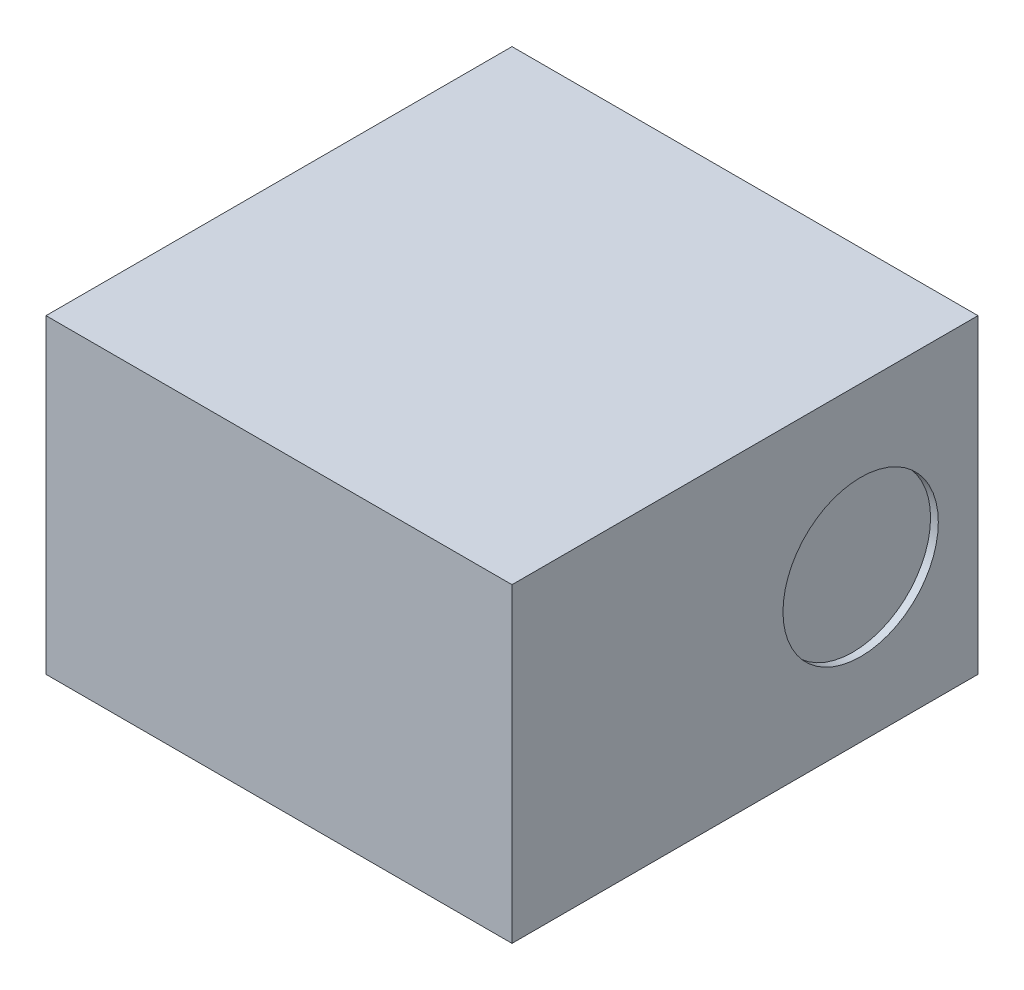
ISO-10303-21;
HEADER;
FILE_DESCRIPTION(('STEP AP214'),'2;1');
FILE_NAME('part.step','',(''),(''),'','','');
FILE_SCHEMA(('AUTOMOTIVE_DESIGN { 1 0 10303 214 1 1 1 1 }'));
ENDSEC;
DATA;
#1=APPLICATION_CONTEXT('core data for automotive mechanical design processes');
#2=APPLICATION_PROTOCOL_DEFINITION('international standard','automotive_design',2000,#1);
#3=PRODUCT_CONTEXT('',#1,'mechanical');
#4=PRODUCT('Part','Part','',(#3));
#5=PRODUCT_RELATED_PRODUCT_CATEGORY('part','',(#4));
#6=PRODUCT_DEFINITION_FORMATION('','',#4);
#7=PRODUCT_DEFINITION_CONTEXT('part definition',#1,'design');
#8=PRODUCT_DEFINITION('design','',#6,#7);
#9=PRODUCT_DEFINITION_SHAPE('','',#8);
#10=(LENGTH_UNIT() NAMED_UNIT(*) SI_UNIT(.MILLI.,.METRE.));
#11=(NAMED_UNIT(*) PLANE_ANGLE_UNIT() SI_UNIT($,.RADIAN.));
#12=(NAMED_UNIT(*) SI_UNIT($,.STERADIAN.) SOLID_ANGLE_UNIT());
#13=UNCERTAINTY_MEASURE_WITH_UNIT(LENGTH_MEASURE(1.E-05),#10,'distance_accuracy_value','');
#14=(GEOMETRIC_REPRESENTATION_CONTEXT(3) GLOBAL_UNCERTAINTY_ASSIGNED_CONTEXT((#13)) GLOBAL_UNIT_ASSIGNED_CONTEXT((#10,
#11,#12)) REPRESENTATION_CONTEXT('',''));
#15=CARTESIAN_POINT('',(0.,0.,0.));
#16=DIRECTION('',(0.,0.,1.));
#17=DIRECTION('',(1.,0.,0.));
#18=AXIS2_PLACEMENT_3D('',#15,#16,#17);
#19=CARTESIAN_POINT('',(-1.5,2.,-1.5));
#20=DIRECTION('',(1.,0.,0.));
#21=DIRECTION('',(0.,0.,-1.));
#22=AXIS2_PLACEMENT_3D('',#19,#20,#21);
#23=PLANE('',#22);
#24=DIRECTION('',(0.,0.,1.));
#25=VECTOR('',#24,1.);
#26=CARTESIAN_POINT('',(-1.5,0.,-1.5));
#27=LINE('',#26,#25);
#28=CARTESIAN_POINT('',(-1.5,0.,-1.5));
#29=VERTEX_POINT('',#28);
#30=CARTESIAN_POINT('',(-1.5,0.,1.5));
#31=VERTEX_POINT('',#30);
#32=EDGE_CURVE('E108',#29,#31,#27,.T.);
#33=ORIENTED_EDGE('',*,*,#32,.T.);
#34=DIRECTION('',(0.,-1.,0.));
#35=VECTOR('',#34,1.);
#36=CARTESIAN_POINT('',(-1.5,2.,1.5));
#37=LINE('',#36,#35);
#38=CARTESIAN_POINT('',(-1.5,2.,1.5));
#39=VERTEX_POINT('',#38);
#40=EDGE_CURVE('E11',#39,#31,#37,.T.);
#41=ORIENTED_EDGE('',*,*,#40,.F.);
#42=DIRECTION('',(0.,0.,1.));
#43=VECTOR('',#42,1.);
#44=CARTESIAN_POINT('',(-1.5,2.,-1.5));
#45=LINE('',#44,#43);
#46=CARTESIAN_POINT('',(-1.5,2.,-1.5));
#47=VERTEX_POINT('',#46);
#48=EDGE_CURVE('E92',#47,#39,#45,.T.);
#49=ORIENTED_EDGE('',*,*,#48,.F.);
#50=DIRECTION('',(0.,-1.,0.));
#51=VECTOR('',#50,1.);
#52=CARTESIAN_POINT('',(-1.5,2.,-1.5));
#53=LINE('',#52,#51);
#54=EDGE_CURVE('E104',#47,#29,#53,.T.);
#55=ORIENTED_EDGE('',*,*,#54,.T.);
#56=EDGE_LOOP('',(#33,#41,#49,#55));
#57=FACE_BOUND('',#56,.T.);
#58=ADVANCED_FACE('F40',(#57),#23,.F.);
#59=CARTESIAN_POINT('',(-1.5,2.,1.5));
#60=DIRECTION('',(0.,0.,-1.));
#61=DIRECTION('',(-1.,0.,0.));
#62=AXIS2_PLACEMENT_3D('',#59,#60,#61);
#63=PLANE('',#62);
#64=DIRECTION('',(1.,0.,0.));
#65=VECTOR('',#64,1.);
#66=CARTESIAN_POINT('',(-1.5,0.,1.5));
#67=LINE('',#66,#65);
#68=CARTESIAN_POINT('',(1.5,0.,1.5));
#69=VERTEX_POINT('',#68);
#70=EDGE_CURVE('E97',#31,#69,#67,.T.);
#71=ORIENTED_EDGE('',*,*,#70,.T.);
#72=DIRECTION('',(0.,-1.,0.));
#73=VECTOR('',#72,1.);
#74=CARTESIAN_POINT('',(1.5,2.,1.5));
#75=LINE('',#74,#73);
#76=CARTESIAN_POINT('',(1.5,2.,1.5));
#77=VERTEX_POINT('',#76);
#78=EDGE_CURVE('E49',#77,#69,#75,.T.);
#79=ORIENTED_EDGE('',*,*,#78,.F.);
#80=DIRECTION('',(1.,0.,0.));
#81=VECTOR('',#80,1.);
#82=CARTESIAN_POINT('',(-1.5,2.,1.5));
#83=LINE('',#82,#81);
#84=EDGE_CURVE('E87',#39,#77,#83,.T.);
#85=ORIENTED_EDGE('',*,*,#84,.F.);
#86=ORIENTED_EDGE('',*,*,#40,.T.);
#87=EDGE_LOOP('',(#71,#79,#85,#86));
#88=FACE_BOUND('',#87,.T.);
#89=ADVANCED_FACE('F96',(#88),#63,.F.);
#90=CARTESIAN_POINT('',(1.5,2.,-1.5));
#91=DIRECTION('',(-1.,0.,0.));
#92=DIRECTION('',(0.,0.,1.));
#93=AXIS2_PLACEMENT_3D('',#90,#91,#92);
#94=PLANE('',#93);
#95=CARTESIAN_POINT('',(1.5,0.976289457581985,-0.744511031925999));
#96=DIRECTION('',(1.,0.,0.));
#97=DIRECTION('',(0.,0.,-1.));
#98=AXIS2_PLACEMENT_3D('',#95,#96,#97);
#99=CIRCLE('',#98,0.5);
#100=CARTESIAN_POINT('',(1.5,0.976289457581985,-1.244511031926));
#101=VERTEX_POINT('',#100);
#102=EDGE_CURVE('E130',#101,#101,#99,.T.);
#103=ORIENTED_EDGE('',*,*,#102,.F.);
#104=EDGE_LOOP('',(#103));
#105=FACE_BOUND('',#104,.T.);
#106=DIRECTION('',(0.,0.,-1.));
#107=VECTOR('',#106,1.);
#108=CARTESIAN_POINT('',(1.5,0.,-1.5));
#109=LINE('',#108,#107);
#110=CARTESIAN_POINT('',(1.5,0.,-1.5));
#111=VERTEX_POINT('',#110);
#112=EDGE_CURVE('E74',#69,#111,#109,.T.);
#113=ORIENTED_EDGE('',*,*,#112,.T.);
#114=DIRECTION('',(0.,-1.,0.));
#115=VECTOR('',#114,1.);
#116=CARTESIAN_POINT('',(1.5,2.,-1.5));
#117=LINE('',#116,#115);
#118=CARTESIAN_POINT('',(1.5,2.,-1.5));
#119=VERTEX_POINT('',#118);
#120=EDGE_CURVE('E99',#119,#111,#117,.T.);
#121=ORIENTED_EDGE('',*,*,#120,.F.);
#122=DIRECTION('',(0.,0.,-1.));
#123=VECTOR('',#122,1.);
#124=CARTESIAN_POINT('',(1.5,2.,-1.5));
#125=LINE('',#124,#123);
#126=EDGE_CURVE('E90',#77,#119,#125,.T.);
#127=ORIENTED_EDGE('',*,*,#126,.F.);
#128=ORIENTED_EDGE('',*,*,#78,.T.);
#129=EDGE_LOOP('',(#113,#121,#127,#128));
#130=FACE_BOUND('',#129,.T.);
#131=ADVANCED_FACE('F100',(#105,#130),#94,.F.);
#132=CARTESIAN_POINT('',(-1.5,2.,-1.5));
#133=DIRECTION('',(0.,0.,1.));
#134=DIRECTION('',(1.,0.,0.));
#135=AXIS2_PLACEMENT_3D('',#132,#133,#134);
#136=PLANE('',#135);
#137=DIRECTION('',(-1.,0.,0.));
#138=VECTOR('',#137,1.);
#139=CARTESIAN_POINT('',(-1.5,0.,-1.5));
#140=LINE('',#139,#138);
#141=EDGE_CURVE('E80',#111,#29,#140,.T.);
#142=ORIENTED_EDGE('',*,*,#141,.T.);
#143=ORIENTED_EDGE('',*,*,#54,.F.);
#144=DIRECTION('',(-1.,0.,0.));
#145=VECTOR('',#144,1.);
#146=CARTESIAN_POINT('',(-1.5,2.,-1.5));
#147=LINE('',#146,#145);
#148=EDGE_CURVE('E57',#119,#47,#147,.T.);
#149=ORIENTED_EDGE('',*,*,#148,.F.);
#150=ORIENTED_EDGE('',*,*,#120,.T.);
#151=EDGE_LOOP('',(#142,#143,#149,#150));
#152=FACE_BOUND('',#151,.T.);
#153=ADVANCED_FACE('F122',(#152),#136,.F.);
#154=CARTESIAN_POINT('',(0.,2.,0.));
#155=DIRECTION('',(0.,1.,0.));
#156=DIRECTION('',(0.,0.,1.));
#157=AXIS2_PLACEMENT_3D('',#154,#155,#156);
#158=PLANE('',#157);
#159=ORIENTED_EDGE('',*,*,#48,.T.);
#160=ORIENTED_EDGE('',*,*,#84,.T.);
#161=ORIENTED_EDGE('',*,*,#126,.T.);
#162=ORIENTED_EDGE('',*,*,#148,.T.);
#163=EDGE_LOOP('',(#159,#160,#161,#162));
#164=FACE_BOUND('',#163,.T.);
#165=ADVANCED_FACE('F88',(#164),#158,.T.);
#166=CARTESIAN_POINT('',(0.,0.,0.));
#167=DIRECTION('',(0.,1.,0.));
#168=DIRECTION('',(0.,0.,1.));
#169=AXIS2_PLACEMENT_3D('',#166,#167,#168);
#170=PLANE('',#169);
#171=ORIENTED_EDGE('',*,*,#32,.F.);
#172=ORIENTED_EDGE('',*,*,#141,.F.);
#173=ORIENTED_EDGE('',*,*,#112,.F.);
#174=ORIENTED_EDGE('',*,*,#70,.F.);
#175=EDGE_LOOP('',(#171,#172,#173,#174));
#176=FACE_BOUND('',#175,.T.);
#177=ADVANCED_FACE('F125',(#176),#170,.F.);
#178=CARTESIAN_POINT('',(1.45,0.976289457581985,-0.744511031925999));
#179=DIRECTION('',(1.,0.,0.));
#180=DIRECTION('',(0.,0.,-1.));
#181=AXIS2_PLACEMENT_3D('',#178,#179,#180);
#182=CYLINDRICAL_SURFACE('',#181,0.5);
#183=CARTESIAN_POINT('',(1.45,0.976289457581985,-0.744511031925999));
#184=DIRECTION('',(1.,0.,0.));
#185=DIRECTION('',(0.,0.,-1.));
#186=AXIS2_PLACEMENT_3D('',#183,#184,#185);
#187=CIRCLE('',#186,0.5);
#188=CARTESIAN_POINT('',(1.45,0.976289457581985,-1.244511031926));
#189=VERTEX_POINT('',#188);
#190=EDGE_CURVE('E112',#189,#189,#187,.T.);
#191=ORIENTED_EDGE('',*,*,#190,.F.);
#192=EDGE_LOOP('',(#191));
#193=FACE_BOUND('',#192,.T.);
#194=ORIENTED_EDGE('',*,*,#102,.T.);
#195=EDGE_LOOP('',(#194));
#196=FACE_BOUND('',#195,.T.);
#197=ADVANCED_FACE('F139',(#193,#196),#182,.F.);
#198=CARTESIAN_POINT('',(1.45,0.976289457581985,-0.744511031925999));
#199=DIRECTION('',(1.,0.,0.));
#200=DIRECTION('',(0.,0.,-1.));
#201=AXIS2_PLACEMENT_3D('',#198,#199,#200);
#202=PLANE('',#201);
#203=ORIENTED_EDGE('',*,*,#190,.T.);
#204=EDGE_LOOP('',(#203));
#205=FACE_BOUND('',#204,.T.);
#206=ADVANCED_FACE('F137',(#205),#202,.T.);
#207=CLOSED_SHELL('',(#58,#89,#131,#153,#165,#177,#197,#206));
#208=MANIFOLD_SOLID_BREP('B2',#207);
#209=ADVANCED_BREP_SHAPE_REPRESENTATION('',(#18,#208),#14);
#210=SHAPE_DEFINITION_REPRESENTATION(#9,#209);
ENDSEC;
END-ISO-10303-21;
